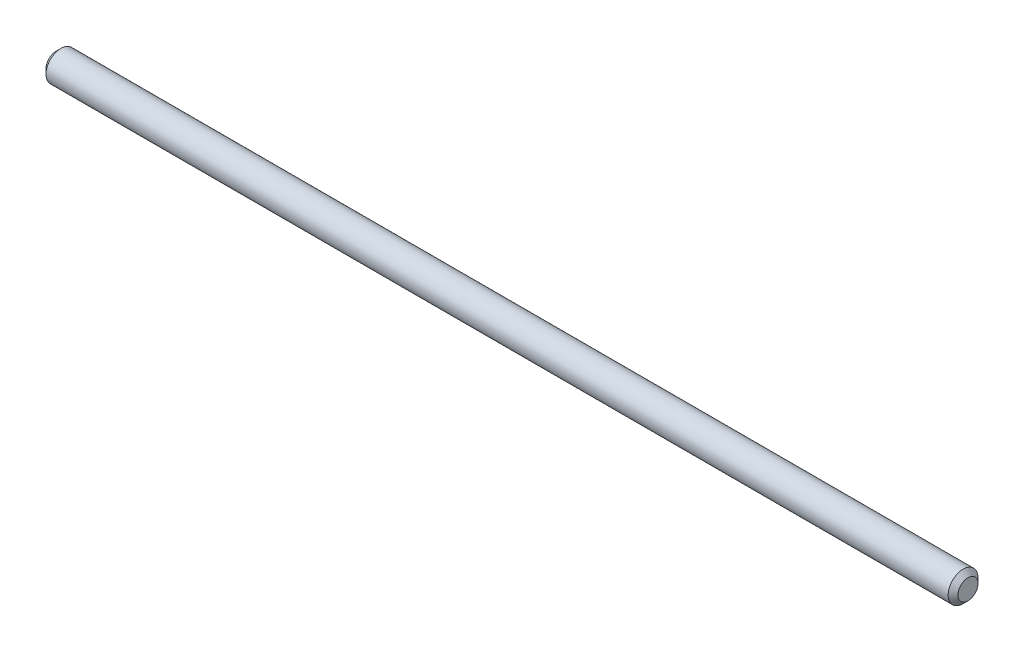
ISO-10303-21;
HEADER;
FILE_DESCRIPTION(('STEP AP214'),'2;1');
FILE_NAME('part.step','',(''),(''),'','','');
FILE_SCHEMA(('AUTOMOTIVE_DESIGN { 1 0 10303 214 1 1 1 1 }'));
ENDSEC;
DATA;
#1=APPLICATION_CONTEXT('core data for automotive mechanical design processes');
#2=APPLICATION_PROTOCOL_DEFINITION('international standard','automotive_design',2000,#1);
#3=PRODUCT_CONTEXT('',#1,'mechanical');
#4=PRODUCT('Part','Part','',(#3));
#5=PRODUCT_RELATED_PRODUCT_CATEGORY('part','',(#4));
#6=PRODUCT_DEFINITION_FORMATION('','',#4);
#7=PRODUCT_DEFINITION_CONTEXT('part definition',#1,'design');
#8=PRODUCT_DEFINITION('design','',#6,#7);
#9=PRODUCT_DEFINITION_SHAPE('','',#8);
#10=(LENGTH_UNIT() NAMED_UNIT(*) SI_UNIT(.MILLI.,.METRE.));
#11=(NAMED_UNIT(*) PLANE_ANGLE_UNIT() SI_UNIT($,.RADIAN.));
#12=(NAMED_UNIT(*) SI_UNIT($,.STERADIAN.) SOLID_ANGLE_UNIT());
#13=UNCERTAINTY_MEASURE_WITH_UNIT(LENGTH_MEASURE(1.E-05),#10,'distance_accuracy_value','');
#14=(GEOMETRIC_REPRESENTATION_CONTEXT(3) GLOBAL_UNCERTAINTY_ASSIGNED_CONTEXT((#13)) GLOBAL_UNIT_ASSIGNED_CONTEXT((#10,
#11,#12)) REPRESENTATION_CONTEXT('',''));
#15=CARTESIAN_POINT('',(0.,0.,0.));
#16=DIRECTION('',(0.,0.,1.));
#17=DIRECTION('',(1.,0.,0.));
#18=AXIS2_PLACEMENT_3D('',#15,#16,#17);
#19=CARTESIAN_POINT('',(-73.66,0.,0.));
#20=DIRECTION('',(1.,0.,0.));
#21=DIRECTION('',(0.,0.,-1.));
#22=AXIS2_PLACEMENT_3D('',#19,#20,#21);
#23=CYLINDRICAL_SURFACE('',#22,2.41299999999999);
#24=CARTESIAN_POINT('',(-72.86625,0.,0.));
#25=DIRECTION('',(1.,0.,0.));
#26=DIRECTION('',(0.,0.,-1.));
#27=AXIS2_PLACEMENT_3D('',#24,#25,#26);
#28=CIRCLE('',#27,2.41299999999999);
#29=CARTESIAN_POINT('',(-72.86625,0.,-2.41299999999999));
#30=VERTEX_POINT('',#29);
#31=EDGE_CURVE('E45',#30,#30,#28,.T.);
#32=ORIENTED_EDGE('',*,*,#31,.T.);
#33=EDGE_LOOP('',(#32));
#34=FACE_BOUND('',#33,.T.);
#35=CARTESIAN_POINT('',(72.86625,0.,0.));
#36=DIRECTION('',(1.,0.,0.));
#37=DIRECTION('',(0.,0.,-1.));
#38=AXIS2_PLACEMENT_3D('',#35,#36,#37);
#39=CIRCLE('',#38,2.41299999999999);
#40=CARTESIAN_POINT('',(72.86625,0.,-2.41299999999999));
#41=VERTEX_POINT('',#40);
#42=EDGE_CURVE('E49',#41,#41,#39,.F.);
#43=ORIENTED_EDGE('',*,*,#42,.T.);
#44=EDGE_LOOP('',(#43));
#45=FACE_BOUND('',#44,.T.);
#46=ADVANCED_FACE('F34',(#34,#45),#23,.T.);
#47=CARTESIAN_POINT('',(-73.66,0.,0.));
#48=DIRECTION('',(1.,0.,0.));
#49=DIRECTION('',(0.,0.,-1.));
#50=AXIS2_PLACEMENT_3D('',#47,#48,#49);
#51=PLANE('',#50);
#52=CARTESIAN_POINT('',(-73.66,0.,0.));
#53=DIRECTION('',(1.,0.,0.));
#54=DIRECTION('',(0.,0.,-1.));
#55=AXIS2_PLACEMENT_3D('',#52,#53,#54);
#56=CIRCLE('',#55,1.61925000000003);
#57=CARTESIAN_POINT('',(-73.66,0.,-1.61925000000003));
#58=VERTEX_POINT('',#57);
#59=EDGE_CURVE('E41',#58,#58,#56,.F.);
#60=ORIENTED_EDGE('',*,*,#59,.T.);
#61=EDGE_LOOP('',(#60));
#62=FACE_BOUND('',#61,.T.);
#63=ADVANCED_FACE('F65',(#62),#51,.F.);
#64=CARTESIAN_POINT('',(73.66,0.,0.));
#65=DIRECTION('',(1.,0.,0.));
#66=DIRECTION('',(0.,0.,-1.));
#67=AXIS2_PLACEMENT_3D('',#64,#65,#66);
#68=PLANE('',#67);
#69=CARTESIAN_POINT('',(73.66,0.,0.));
#70=DIRECTION('',(1.,0.,0.));
#71=DIRECTION('',(0.,0.,-1.));
#72=AXIS2_PLACEMENT_3D('',#69,#70,#71);
#73=CIRCLE('',#72,1.61924999999997);
#74=CARTESIAN_POINT('',(73.66,0.,-1.61924999999997));
#75=VERTEX_POINT('',#74);
#76=EDGE_CURVE('E10',#75,#75,#73,.T.);
#77=ORIENTED_EDGE('',*,*,#76,.T.);
#78=EDGE_LOOP('',(#77));
#79=FACE_BOUND('',#78,.T.);
#80=ADVANCED_FACE('F62',(#79),#68,.T.);
#81=CARTESIAN_POINT('',(-72.86625,0.,0.));
#82=DIRECTION('',(1.,0.,0.));
#83=DIRECTION('',(0.,0.,-1.));
#84=AXIS2_PLACEMENT_3D('',#81,#82,#83);
#85=CONICAL_SURFACE('',#84,2.41299999999999,0.785398163397444);
#86=ORIENTED_EDGE('',*,*,#59,.F.);
#87=EDGE_LOOP('',(#86));
#88=FACE_BOUND('',#87,.T.);
#89=ORIENTED_EDGE('',*,*,#31,.F.);
#90=EDGE_LOOP('',(#89));
#91=FACE_BOUND('',#90,.T.);
#92=ADVANCED_FACE('F58',(#88,#91),#85,.T.);
#93=CARTESIAN_POINT('',(73.66,0.,0.));
#94=DIRECTION('',(-1.,0.,0.));
#95=DIRECTION('',(0.,0.,1.));
#96=AXIS2_PLACEMENT_3D('',#93,#94,#95);
#97=CONICAL_SURFACE('',#96,1.61924999999997,0.785398163397452);
#98=ORIENTED_EDGE('',*,*,#42,.F.);
#99=EDGE_LOOP('',(#98));
#100=FACE_BOUND('',#99,.T.);
#101=ORIENTED_EDGE('',*,*,#76,.F.);
#102=EDGE_LOOP('',(#101));
#103=FACE_BOUND('',#102,.T.);
#104=ADVANCED_FACE('F36',(#100,#103),#97,.T.);
#105=CLOSED_SHELL('',(#46,#63,#80,#92,#104));
#106=MANIFOLD_SOLID_BREP('B2',#105);
#107=ADVANCED_BREP_SHAPE_REPRESENTATION('',(#18,#106),#14);
#108=SHAPE_DEFINITION_REPRESENTATION(#9,#107);
ENDSEC;
END-ISO-10303-21;
